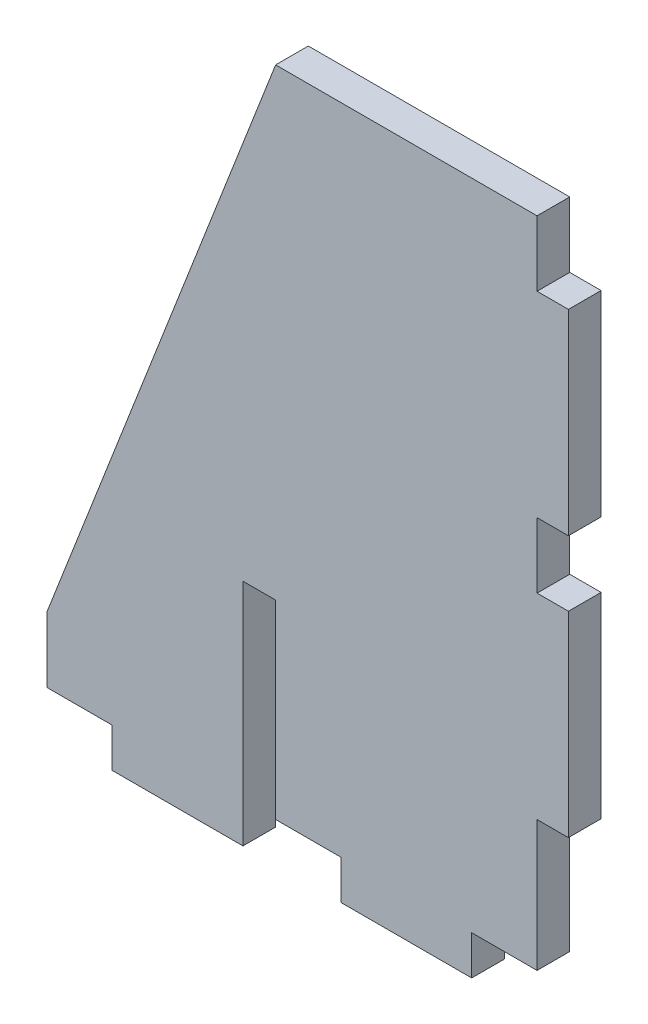
ISO-10303-21;
HEADER;
FILE_DESCRIPTION(('STEP AP214'),'2;1');
FILE_NAME('part.step','',(''),(''),'','','');
FILE_SCHEMA(('AUTOMOTIVE_DESIGN { 1 0 10303 214 1 1 1 1 }'));
ENDSEC;
DATA;
#1=APPLICATION_CONTEXT('core data for automotive mechanical design processes');
#2=APPLICATION_PROTOCOL_DEFINITION('international standard','automotive_design',2000,#1);
#3=PRODUCT_CONTEXT('',#1,'mechanical');
#4=PRODUCT('Part','Part','',(#3));
#5=PRODUCT_RELATED_PRODUCT_CATEGORY('part','',(#4));
#6=PRODUCT_DEFINITION_FORMATION('','',#4);
#7=PRODUCT_DEFINITION_CONTEXT('part definition',#1,'design');
#8=PRODUCT_DEFINITION('design','',#6,#7);
#9=PRODUCT_DEFINITION_SHAPE('','',#8);
#10=(LENGTH_UNIT() NAMED_UNIT(*) SI_UNIT(.MILLI.,.METRE.));
#11=(NAMED_UNIT(*) PLANE_ANGLE_UNIT() SI_UNIT($,.RADIAN.));
#12=(NAMED_UNIT(*) SI_UNIT($,.STERADIAN.) SOLID_ANGLE_UNIT());
#13=UNCERTAINTY_MEASURE_WITH_UNIT(LENGTH_MEASURE(1.E-05),#10,'distance_accuracy_value','');
#14=(GEOMETRIC_REPRESENTATION_CONTEXT(3) GLOBAL_UNCERTAINTY_ASSIGNED_CONTEXT((#13)) GLOBAL_UNIT_ASSIGNED_CONTEXT((#10,
#11,#12)) REPRESENTATION_CONTEXT('',''));
#15=CARTESIAN_POINT('',(0.,0.,0.));
#16=DIRECTION('',(0.,0.,1.));
#17=DIRECTION('',(1.,0.,0.));
#18=AXIS2_PLACEMENT_3D('',#15,#16,#17);
#19=CARTESIAN_POINT('',(-19.05,0.,3.175));
#20=DIRECTION('',(0.,-1.,0.));
#21=DIRECTION('',(1.,0.,0.));
#22=AXIS2_PLACEMENT_3D('',#19,#20,#21);
#23=PLANE('',#22);
#24=DIRECTION('',(-1.,0.,0.));
#25=VECTOR('',#24,1.);
#26=CARTESIAN_POINT('',(-19.05,0.,0.));
#27=LINE('',#26,#25);
#28=CARTESIAN_POINT('',(-19.05,0.,0.));
#29=VERTEX_POINT('',#28);
#30=CARTESIAN_POINT('',(-25.4,0.,0.));
#31=VERTEX_POINT('',#30);
#32=EDGE_CURVE('E234',#29,#31,#27,.T.);
#33=ORIENTED_EDGE('',*,*,#32,.F.);
#34=DIRECTION('',(0.,0.,-1.));
#35=VECTOR('',#34,1.);
#36=CARTESIAN_POINT('',(-19.05,0.,3.175));
#37=LINE('',#36,#35);
#38=CARTESIAN_POINT('',(-19.05,0.,3.175));
#39=VERTEX_POINT('',#38);
#40=EDGE_CURVE('E11',#39,#29,#37,.T.);
#41=ORIENTED_EDGE('',*,*,#40,.F.);
#42=DIRECTION('',(-1.,0.,0.));
#43=VECTOR('',#42,1.);
#44=CARTESIAN_POINT('',(-19.05,0.,3.175));
#45=LINE('',#44,#43);
#46=CARTESIAN_POINT('',(-25.4,0.,3.175));
#47=VERTEX_POINT('',#46);
#48=EDGE_CURVE('E319',#39,#47,#45,.T.);
#49=ORIENTED_EDGE('',*,*,#48,.T.);
#50=DIRECTION('',(0.,0.,-1.));
#51=VECTOR('',#50,1.);
#52=CARTESIAN_POINT('',(-25.4,0.,3.175));
#53=LINE('',#52,#51);
#54=EDGE_CURVE('E42',#47,#31,#53,.T.);
#55=ORIENTED_EDGE('',*,*,#54,.T.);
#56=EDGE_LOOP('',(#33,#41,#49,#55));
#57=FACE_BOUND('',#56,.T.);
#58=ADVANCED_FACE('F39',(#57),#23,.T.);
#59=CARTESIAN_POINT('',(-19.05,0.,3.175));
#60=DIRECTION('',(1.,0.,0.));
#61=DIRECTION('',(0.,0.,-1.));
#62=AXIS2_PLACEMENT_3D('',#59,#60,#61);
#63=PLANE('',#62);
#64=DIRECTION('',(0.,-1.,0.));
#65=VECTOR('',#64,1.);
#66=CARTESIAN_POINT('',(-19.05,0.,0.));
#67=LINE('',#66,#65);
#68=CARTESIAN_POINT('',(-19.05,-3.81,0.));
#69=VERTEX_POINT('',#68);
#70=EDGE_CURVE('E130',#29,#69,#67,.T.);
#71=ORIENTED_EDGE('',*,*,#70,.T.);
#72=DIRECTION('',(0.,0.,-1.));
#73=VECTOR('',#72,1.);
#74=CARTESIAN_POINT('',(-19.05,-3.81,3.175));
#75=LINE('',#74,#73);
#76=CARTESIAN_POINT('',(-19.05,-3.81,3.175));
#77=VERTEX_POINT('',#76);
#78=EDGE_CURVE('E49',#77,#69,#75,.T.);
#79=ORIENTED_EDGE('',*,*,#78,.F.);
#80=DIRECTION('',(0.,-1.,0.));
#81=VECTOR('',#80,1.);
#82=CARTESIAN_POINT('',(-19.05,0.,3.175));
#83=LINE('',#82,#81);
#84=EDGE_CURVE('E207',#39,#77,#83,.T.);
#85=ORIENTED_EDGE('',*,*,#84,.F.);
#86=ORIENTED_EDGE('',*,*,#40,.T.);
#87=EDGE_LOOP('',(#71,#79,#85,#86));
#88=FACE_BOUND('',#87,.T.);
#89=ADVANCED_FACE('F533',(#88),#63,.F.);
#90=CARTESIAN_POINT('',(-19.05,-3.81,3.175));
#91=DIRECTION('',(0.,1.,0.));
#92=DIRECTION('',(-1.,0.,0.));
#93=AXIS2_PLACEMENT_3D('',#90,#91,#92);
#94=PLANE('',#93);
#95=DIRECTION('',(1.,0.,0.));
#96=VECTOR('',#95,1.);
#97=CARTESIAN_POINT('',(-19.05,-3.81,0.));
#98=LINE('',#97,#96);
#99=CARTESIAN_POINT('',(-6.35,-3.81,0.));
#100=VERTEX_POINT('',#99);
#101=EDGE_CURVE('E215',#69,#100,#98,.T.);
#102=ORIENTED_EDGE('',*,*,#101,.T.);
#103=DIRECTION('',(0.,0.,-1.));
#104=VECTOR('',#103,1.);
#105=CARTESIAN_POINT('',(-6.35,-3.81,3.175));
#106=LINE('',#105,#104);
#107=CARTESIAN_POINT('',(-6.35,-3.81,3.175));
#108=VERTEX_POINT('',#107);
#109=EDGE_CURVE('E212',#108,#100,#106,.T.);
#110=ORIENTED_EDGE('',*,*,#109,.F.);
#111=DIRECTION('',(1.,0.,0.));
#112=VECTOR('',#111,1.);
#113=CARTESIAN_POINT('',(-19.05,-3.81,3.175));
#114=LINE('',#113,#112);
#115=EDGE_CURVE('E199',#77,#108,#114,.T.);
#116=ORIENTED_EDGE('',*,*,#115,.F.);
#117=ORIENTED_EDGE('',*,*,#78,.T.);
#118=EDGE_LOOP('',(#102,#110,#116,#117));
#119=FACE_BOUND('',#118,.T.);
#120=ADVANCED_FACE('F213',(#119),#94,.F.);
#121=CARTESIAN_POINT('',(-6.35,-3.81,3.175));
#122=DIRECTION('',(-1.,0.,0.));
#123=DIRECTION('',(0.,0.,1.));
#124=AXIS2_PLACEMENT_3D('',#121,#122,#123);
#125=PLANE('',#124);
#126=DIRECTION('',(0.,1.,0.));
#127=VECTOR('',#126,1.);
#128=CARTESIAN_POINT('',(-6.35,-3.81,0.));
#129=LINE('',#128,#127);
#130=CARTESIAN_POINT('',(-6.35,0.,0.));
#131=VERTEX_POINT('',#130);
#132=EDGE_CURVE('E313',#100,#131,#129,.T.);
#133=ORIENTED_EDGE('',*,*,#132,.T.);
#134=DIRECTION('',(0.,0.,-1.));
#135=VECTOR('',#134,1.);
#136=CARTESIAN_POINT('',(-6.35,0.,3.175));
#137=LINE('',#136,#135);
#138=CARTESIAN_POINT('',(-6.35,0.,3.175));
#139=VERTEX_POINT('',#138);
#140=EDGE_CURVE('E220',#139,#131,#137,.T.);
#141=ORIENTED_EDGE('',*,*,#140,.F.);
#142=DIRECTION('',(0.,1.,0.));
#143=VECTOR('',#142,1.);
#144=CARTESIAN_POINT('',(-6.35,-3.81,3.175));
#145=LINE('',#144,#143);
#146=EDGE_CURVE('E205',#108,#139,#145,.T.);
#147=ORIENTED_EDGE('',*,*,#146,.F.);
#148=ORIENTED_EDGE('',*,*,#109,.T.);
#149=EDGE_LOOP('',(#133,#141,#147,#148));
#150=FACE_BOUND('',#149,.T.);
#151=ADVANCED_FACE('F222',(#150),#125,.F.);
#152=CARTESIAN_POINT('',(0.,0.,3.175));
#153=DIRECTION('',(0.,-1.,0.));
#154=DIRECTION('',(1.,0.,0.));
#155=AXIS2_PLACEMENT_3D('',#152,#153,#154);
#156=PLANE('',#155);
#157=DIRECTION('',(-1.,0.,0.));
#158=VECTOR('',#157,1.);
#159=CARTESIAN_POINT('',(0.,0.,0.));
#160=LINE('',#159,#158);
#161=CARTESIAN_POINT('',(0.,0.,0.));
#162=VERTEX_POINT('',#161);
#163=EDGE_CURVE('E309',#162,#131,#160,.T.);
#164=ORIENTED_EDGE('',*,*,#163,.F.);
#165=DIRECTION('',(0.,0.,-1.));
#166=VECTOR('',#165,1.);
#167=CARTESIAN_POINT('',(0.,0.,3.175));
#168=LINE('',#167,#166);
#169=CARTESIAN_POINT('',(0.,0.,3.175));
#170=VERTEX_POINT('',#169);
#171=EDGE_CURVE('E325',#170,#162,#168,.T.);
#172=ORIENTED_EDGE('',*,*,#171,.F.);
#173=DIRECTION('',(-1.,0.,0.));
#174=VECTOR('',#173,1.);
#175=CARTESIAN_POINT('',(0.,0.,3.175));
#176=LINE('',#175,#174);
#177=EDGE_CURVE('E225',#170,#139,#176,.T.);
#178=ORIENTED_EDGE('',*,*,#177,.T.);
#179=ORIENTED_EDGE('',*,*,#140,.T.);
#180=EDGE_LOOP('',(#164,#172,#178,#179));
#181=FACE_BOUND('',#180,.T.);
#182=ADVANCED_FACE('F387',(#181),#156,.T.);
#183=CARTESIAN_POINT('',(0.,0.,3.175));
#184=DIRECTION('',(-1.,0.,0.));
#185=DIRECTION('',(0.,-1.,0.));
#186=AXIS2_PLACEMENT_3D('',#183,#184,#185);
#187=PLANE('',#186);
#188=DIRECTION('',(0.,1.,0.));
#189=VECTOR('',#188,1.);
#190=CARTESIAN_POINT('',(0.,0.,0.));
#191=LINE('',#190,#189);
#192=CARTESIAN_POINT('',(0.,12.7,0.));
#193=VERTEX_POINT('',#192);
#194=EDGE_CURVE('E305',#162,#193,#191,.T.);
#195=ORIENTED_EDGE('',*,*,#194,.T.);
#196=DIRECTION('',(0.,0.,-1.));
#197=VECTOR('',#196,1.);
#198=CARTESIAN_POINT('',(0.,12.7,3.175));
#199=LINE('',#198,#197);
#200=CARTESIAN_POINT('',(0.,12.7,3.175));
#201=VERTEX_POINT('',#200);
#202=EDGE_CURVE('E328',#201,#193,#199,.T.);
#203=ORIENTED_EDGE('',*,*,#202,.F.);
#204=DIRECTION('',(0.,1.,0.));
#205=VECTOR('',#204,1.);
#206=CARTESIAN_POINT('',(0.,0.,3.175));
#207=LINE('',#206,#205);
#208=EDGE_CURVE('E228',#170,#201,#207,.T.);
#209=ORIENTED_EDGE('',*,*,#208,.F.);
#210=ORIENTED_EDGE('',*,*,#171,.T.);
#211=EDGE_LOOP('',(#195,#203,#209,#210));
#212=FACE_BOUND('',#211,.T.);
#213=ADVANCED_FACE('F397',(#212),#187,.F.);
#214=CARTESIAN_POINT('',(3.048,12.7,3.175));
#215=DIRECTION('',(0.,-1.,0.));
#216=DIRECTION('',(0.,0.,-1.));
#217=AXIS2_PLACEMENT_3D('',#214,#215,#216);
#218=PLANE('',#217);
#219=DIRECTION('',(-1.,0.,0.));
#220=VECTOR('',#219,1.);
#221=CARTESIAN_POINT('',(3.048,12.7,0.));
#222=LINE('',#221,#220);
#223=CARTESIAN_POINT('',(3.048,12.7,0.));
#224=VERTEX_POINT('',#223);
#225=EDGE_CURVE('E301',#224,#193,#222,.T.);
#226=ORIENTED_EDGE('',*,*,#225,.F.);
#227=DIRECTION('',(0.,0.,-1.));
#228=VECTOR('',#227,1.);
#229=CARTESIAN_POINT('',(3.048,12.7,3.175));
#230=LINE('',#229,#228);
#231=CARTESIAN_POINT('',(3.048,12.7,3.175));
#232=VERTEX_POINT('',#231);
#233=EDGE_CURVE('E331',#232,#224,#230,.T.);
#234=ORIENTED_EDGE('',*,*,#233,.F.);
#235=DIRECTION('',(-1.,0.,0.));
#236=VECTOR('',#235,1.);
#237=CARTESIAN_POINT('',(3.048,12.7,3.175));
#238=LINE('',#237,#236);
#239=EDGE_CURVE('E393',#232,#201,#238,.T.);
#240=ORIENTED_EDGE('',*,*,#239,.T.);
#241=ORIENTED_EDGE('',*,*,#202,.T.);
#242=EDGE_LOOP('',(#226,#234,#240,#241));
#243=FACE_BOUND('',#242,.T.);
#244=ADVANCED_FACE('F400',(#243),#218,.T.);
#245=CARTESIAN_POINT('',(3.048,31.75,3.175));
#246=DIRECTION('',(1.,0.,0.));
#247=DIRECTION('',(0.,1.,0.));
#248=AXIS2_PLACEMENT_3D('',#245,#246,#247);
#249=PLANE('',#248);
#250=DIRECTION('',(0.,-1.,0.));
#251=VECTOR('',#250,1.);
#252=CARTESIAN_POINT('',(3.048,31.75,0.));
#253=LINE('',#252,#251);
#254=CARTESIAN_POINT('',(3.048,31.75,0.));
#255=VERTEX_POINT('',#254);
#256=EDGE_CURVE('E297',#255,#224,#253,.T.);
#257=ORIENTED_EDGE('',*,*,#256,.F.);
#258=DIRECTION('',(0.,0.,-1.));
#259=VECTOR('',#258,1.);
#260=CARTESIAN_POINT('',(3.048,31.75,3.175));
#261=LINE('',#260,#259);
#262=CARTESIAN_POINT('',(3.048,31.75,3.175));
#263=VERTEX_POINT('',#262);
#264=EDGE_CURVE('E334',#263,#255,#261,.T.);
#265=ORIENTED_EDGE('',*,*,#264,.F.);
#266=DIRECTION('',(0.,-1.,0.));
#267=VECTOR('',#266,1.);
#268=CARTESIAN_POINT('',(3.048,31.75,3.175));
#269=LINE('',#268,#267);
#270=EDGE_CURVE('E402',#263,#232,#269,.T.);
#271=ORIENTED_EDGE('',*,*,#270,.T.);
#272=ORIENTED_EDGE('',*,*,#233,.T.);
#273=EDGE_LOOP('',(#257,#265,#271,#272));
#274=FACE_BOUND('',#273,.T.);
#275=ADVANCED_FACE('F523',(#274),#249,.T.);
#276=CARTESIAN_POINT('',(0.,31.75,3.175));
#277=DIRECTION('',(0.,1.,0.));
#278=DIRECTION('',(0.,0.,1.));
#279=AXIS2_PLACEMENT_3D('',#276,#277,#278);
#280=PLANE('',#279);
#281=DIRECTION('',(1.,0.,0.));
#282=VECTOR('',#281,1.);
#283=CARTESIAN_POINT('',(0.,31.75,0.));
#284=LINE('',#283,#282);
#285=CARTESIAN_POINT('',(0.,31.75,0.));
#286=VERTEX_POINT('',#285);
#287=EDGE_CURVE('E293',#286,#255,#284,.T.);
#288=ORIENTED_EDGE('',*,*,#287,.F.);
#289=DIRECTION('',(0.,0.,-1.));
#290=VECTOR('',#289,1.);
#291=CARTESIAN_POINT('',(0.,31.75,3.175));
#292=LINE('',#291,#290);
#293=CARTESIAN_POINT('',(0.,31.75,3.175));
#294=VERTEX_POINT('',#293);
#295=EDGE_CURVE('E337',#294,#286,#292,.T.);
#296=ORIENTED_EDGE('',*,*,#295,.F.);
#297=DIRECTION('',(1.,0.,0.));
#298=VECTOR('',#297,1.);
#299=CARTESIAN_POINT('',(0.,31.75,3.175));
#300=LINE('',#299,#298);
#301=EDGE_CURVE('E405',#294,#263,#300,.T.);
#302=ORIENTED_EDGE('',*,*,#301,.T.);
#303=ORIENTED_EDGE('',*,*,#264,.T.);
#304=EDGE_LOOP('',(#288,#296,#302,#303));
#305=FACE_BOUND('',#304,.T.);
#306=ADVANCED_FACE('F519',(#305),#280,.T.);
#307=CARTESIAN_POINT('',(0.,31.75,3.175));
#308=DIRECTION('',(-1.,0.,0.));
#309=DIRECTION('',(0.,0.,1.));
#310=AXIS2_PLACEMENT_3D('',#307,#308,#309);
#311=PLANE('',#310);
#312=DIRECTION('',(0.,1.,0.));
#313=VECTOR('',#312,1.);
#314=CARTESIAN_POINT('',(0.,31.75,0.));
#315=LINE('',#314,#313);
#316=CARTESIAN_POINT('',(0.,38.1,0.));
#317=VERTEX_POINT('',#316);
#318=EDGE_CURVE('E289',#286,#317,#315,.T.);
#319=ORIENTED_EDGE('',*,*,#318,.T.);
#320=DIRECTION('',(0.,0.,-1.));
#321=VECTOR('',#320,1.);
#322=CARTESIAN_POINT('',(0.,38.1,3.175));
#323=LINE('',#322,#321);
#324=CARTESIAN_POINT('',(0.,38.1,3.175));
#325=VERTEX_POINT('',#324);
#326=EDGE_CURVE('E340',#325,#317,#323,.T.);
#327=ORIENTED_EDGE('',*,*,#326,.F.);
#328=DIRECTION('',(0.,1.,0.));
#329=VECTOR('',#328,1.);
#330=CARTESIAN_POINT('',(0.,31.75,3.175));
#331=LINE('',#330,#329);
#332=EDGE_CURVE('E411',#294,#325,#331,.T.);
#333=ORIENTED_EDGE('',*,*,#332,.F.);
#334=ORIENTED_EDGE('',*,*,#295,.T.);
#335=EDGE_LOOP('',(#319,#327,#333,#334));
#336=FACE_BOUND('',#335,.T.);
#337=ADVANCED_FACE('F516',(#336),#311,.F.);
#338=CARTESIAN_POINT('',(3.048,38.1,3.175));
#339=DIRECTION('',(0.,-1.,0.));
#340=DIRECTION('',(0.,0.,-1.));
#341=AXIS2_PLACEMENT_3D('',#338,#339,#340);
#342=PLANE('',#341);
#343=DIRECTION('',(-1.,0.,0.));
#344=VECTOR('',#343,1.);
#345=CARTESIAN_POINT('',(3.048,38.1,0.));
#346=LINE('',#345,#344);
#347=CARTESIAN_POINT('',(3.048,38.1,0.));
#348=VERTEX_POINT('',#347);
#349=EDGE_CURVE('E285',#348,#317,#346,.T.);
#350=ORIENTED_EDGE('',*,*,#349,.F.);
#351=DIRECTION('',(0.,0.,-1.));
#352=VECTOR('',#351,1.);
#353=CARTESIAN_POINT('',(3.048,38.1,3.175));
#354=LINE('',#353,#352);
#355=CARTESIAN_POINT('',(3.048,38.1,3.175));
#356=VERTEX_POINT('',#355);
#357=EDGE_CURVE('E343',#356,#348,#354,.T.);
#358=ORIENTED_EDGE('',*,*,#357,.F.);
#359=DIRECTION('',(-1.,0.,0.));
#360=VECTOR('',#359,1.);
#361=CARTESIAN_POINT('',(3.048,38.1,3.175));
#362=LINE('',#361,#360);
#363=EDGE_CURVE('E414',#356,#325,#362,.T.);
#364=ORIENTED_EDGE('',*,*,#363,.T.);
#365=ORIENTED_EDGE('',*,*,#326,.T.);
#366=EDGE_LOOP('',(#350,#358,#364,#365));
#367=FACE_BOUND('',#366,.T.);
#368=ADVANCED_FACE('F512',(#367),#342,.T.);
#369=CARTESIAN_POINT('',(3.048,57.15,3.175));
#370=DIRECTION('',(1.,0.,0.));
#371=DIRECTION('',(0.,1.,0.));
#372=AXIS2_PLACEMENT_3D('',#369,#370,#371);
#373=PLANE('',#372);
#374=DIRECTION('',(0.,-1.,0.));
#375=VECTOR('',#374,1.);
#376=CARTESIAN_POINT('',(3.048,57.15,0.));
#377=LINE('',#376,#375);
#378=CARTESIAN_POINT('',(3.048,57.15,0.));
#379=VERTEX_POINT('',#378);
#380=EDGE_CURVE('E281',#379,#348,#377,.T.);
#381=ORIENTED_EDGE('',*,*,#380,.F.);
#382=DIRECTION('',(0.,0.,-1.));
#383=VECTOR('',#382,1.);
#384=CARTESIAN_POINT('',(3.048,57.15,3.175));
#385=LINE('',#384,#383);
#386=CARTESIAN_POINT('',(3.048,57.15,3.175));
#387=VERTEX_POINT('',#386);
#388=EDGE_CURVE('E346',#387,#379,#385,.T.);
#389=ORIENTED_EDGE('',*,*,#388,.F.);
#390=DIRECTION('',(0.,-1.,0.));
#391=VECTOR('',#390,1.);
#392=CARTESIAN_POINT('',(3.048,57.15,3.175));
#393=LINE('',#392,#391);
#394=EDGE_CURVE('E418',#387,#356,#393,.T.);
#395=ORIENTED_EDGE('',*,*,#394,.T.);
#396=ORIENTED_EDGE('',*,*,#357,.T.);
#397=EDGE_LOOP('',(#381,#389,#395,#396));
#398=FACE_BOUND('',#397,.T.);
#399=ADVANCED_FACE('F508',(#398),#373,.T.);
#400=CARTESIAN_POINT('',(0.,57.15,3.175));
#401=DIRECTION('',(0.,1.,0.));
#402=DIRECTION('',(0.,0.,1.));
#403=AXIS2_PLACEMENT_3D('',#400,#401,#402);
#404=PLANE('',#403);
#405=DIRECTION('',(1.,0.,0.));
#406=VECTOR('',#405,1.);
#407=CARTESIAN_POINT('',(0.,57.15,0.));
#408=LINE('',#407,#406);
#409=CARTESIAN_POINT('',(0.,57.15,0.));
#410=VERTEX_POINT('',#409);
#411=EDGE_CURVE('E277',#410,#379,#408,.T.);
#412=ORIENTED_EDGE('',*,*,#411,.F.);
#413=DIRECTION('',(0.,0.,-1.));
#414=VECTOR('',#413,1.);
#415=CARTESIAN_POINT('',(0.,57.15,3.175));
#416=LINE('',#415,#414);
#417=CARTESIAN_POINT('',(0.,57.15,3.175));
#418=VERTEX_POINT('',#417);
#419=EDGE_CURVE('E349',#418,#410,#416,.T.);
#420=ORIENTED_EDGE('',*,*,#419,.F.);
#421=DIRECTION('',(1.,0.,0.));
#422=VECTOR('',#421,1.);
#423=CARTESIAN_POINT('',(0.,57.15,3.175));
#424=LINE('',#423,#422);
#425=EDGE_CURVE('E422',#418,#387,#424,.T.);
#426=ORIENTED_EDGE('',*,*,#425,.T.);
#427=ORIENTED_EDGE('',*,*,#388,.T.);
#428=EDGE_LOOP('',(#412,#420,#426,#427));
#429=FACE_BOUND('',#428,.T.);
#430=ADVANCED_FACE('F503',(#429),#404,.T.);
#431=CARTESIAN_POINT('',(0.,57.15,3.175));
#432=DIRECTION('',(-1.,0.,0.));
#433=DIRECTION('',(0.,0.,1.));
#434=AXIS2_PLACEMENT_3D('',#431,#432,#433);
#435=PLANE('',#434);
#436=DIRECTION('',(0.,1.,0.));
#437=VECTOR('',#436,1.);
#438=CARTESIAN_POINT('',(0.,57.15,0.));
#439=LINE('',#438,#437);
#440=CARTESIAN_POINT('',(0.,63.5,0.));
#441=VERTEX_POINT('',#440);
#442=EDGE_CURVE('E274',#410,#441,#439,.T.);
#443=ORIENTED_EDGE('',*,*,#442,.T.);
#444=DIRECTION('',(0.,0.,-1.));
#445=VECTOR('',#444,1.);
#446=CARTESIAN_POINT('',(0.,63.5,3.175));
#447=LINE('',#446,#445);
#448=CARTESIAN_POINT('',(0.,63.5,3.175));
#449=VERTEX_POINT('',#448);
#450=EDGE_CURVE('E352',#449,#441,#447,.T.);
#451=ORIENTED_EDGE('',*,*,#450,.F.);
#452=DIRECTION('',(0.,1.,0.));
#453=VECTOR('',#452,1.);
#454=CARTESIAN_POINT('',(0.,57.15,3.175));
#455=LINE('',#454,#453);
#456=EDGE_CURVE('E426',#418,#449,#455,.T.);
#457=ORIENTED_EDGE('',*,*,#456,.F.);
#458=ORIENTED_EDGE('',*,*,#419,.T.);
#459=EDGE_LOOP('',(#443,#451,#457,#458));
#460=FACE_BOUND('',#459,.T.);
#461=ADVANCED_FACE('F500',(#460),#435,.F.);
#462=CARTESIAN_POINT('',(0.,63.5,3.175));
#463=DIRECTION('',(0.,-1.,0.));
#464=DIRECTION('',(1.,0.,0.));
#465=AXIS2_PLACEMENT_3D('',#462,#463,#464);
#466=PLANE('',#465);
#467=DIRECTION('',(-1.,0.,0.));
#468=VECTOR('',#467,1.);
#469=CARTESIAN_POINT('',(0.,63.5,0.));
#470=LINE('',#469,#468);
#471=CARTESIAN_POINT('',(-25.4,63.5,0.));
#472=VERTEX_POINT('',#471);
#473=EDGE_CURVE('E270',#441,#472,#470,.T.);
#474=ORIENTED_EDGE('',*,*,#473,.T.);
#475=DIRECTION('',(0.,0.,-1.));
#476=VECTOR('',#475,1.);
#477=CARTESIAN_POINT('',(-25.4,63.5,3.175));
#478=LINE('',#477,#476);
#479=CARTESIAN_POINT('',(-25.4,63.5,3.175));
#480=VERTEX_POINT('',#479);
#481=EDGE_CURVE('E356',#480,#472,#478,.T.);
#482=ORIENTED_EDGE('',*,*,#481,.F.);
#483=DIRECTION('',(-1.,0.,0.));
#484=VECTOR('',#483,1.);
#485=CARTESIAN_POINT('',(0.,63.5,3.175));
#486=LINE('',#485,#484);
#487=EDGE_CURVE('E429',#449,#480,#486,.T.);
#488=ORIENTED_EDGE('',*,*,#487,.F.);
#489=ORIENTED_EDGE('',*,*,#450,.T.);
#490=EDGE_LOOP('',(#474,#482,#488,#489));
#491=FACE_BOUND('',#490,.T.);
#492=ADVANCED_FACE('F495',(#491),#466,.F.);
#493=CARTESIAN_POINT('',(-47.625,6.35000000000001,3.175));
#494=DIRECTION('',(-0.932004671541296,0.362446261154949,0.));
#495=DIRECTION('',(-0.362446261154949,-0.932004671541296,0.));
#496=AXIS2_PLACEMENT_3D('',#493,#494,#495);
#497=PLANE('',#496);
#498=DIRECTION('',(0.362446261154949,0.932004671541296,0.));
#499=VECTOR('',#498,1.);
#500=CARTESIAN_POINT('',(-47.625,6.35000000000001,0.));
#501=LINE('',#500,#499);
#502=CARTESIAN_POINT('',(-47.625,6.35000000000001,0.));
#503=VERTEX_POINT('',#502);
#504=EDGE_CURVE('E266',#503,#472,#501,.T.);
#505=ORIENTED_EDGE('',*,*,#504,.F.);
#506=DIRECTION('',(0.,0.,-1.));
#507=VECTOR('',#506,1.);
#508=CARTESIAN_POINT('',(-47.625,6.35000000000001,3.175));
#509=LINE('',#508,#507);
#510=CARTESIAN_POINT('',(-47.625,6.35000000000001,3.175));
#511=VERTEX_POINT('',#510);
#512=EDGE_CURVE('E359',#511,#503,#509,.T.);
#513=ORIENTED_EDGE('',*,*,#512,.F.);
#514=DIRECTION('',(0.362446261154949,0.932004671541296,0.));
#515=VECTOR('',#514,1.);
#516=CARTESIAN_POINT('',(-47.625,6.35000000000001,3.175));
#517=LINE('',#516,#515);
#518=EDGE_CURVE('E432',#511,#480,#517,.T.);
#519=ORIENTED_EDGE('',*,*,#518,.T.);
#520=ORIENTED_EDGE('',*,*,#481,.T.);
#521=EDGE_LOOP('',(#505,#513,#519,#520));
#522=FACE_BOUND('',#521,.T.);
#523=ADVANCED_FACE('F489',(#522),#497,.T.);
#524=CARTESIAN_POINT('',(-47.625,0.,3.175));
#525=DIRECTION('',(-1.,0.,0.));
#526=DIRECTION('',(0.,0.,1.));
#527=AXIS2_PLACEMENT_3D('',#524,#525,#526);
#528=PLANE('',#527);
#529=DIRECTION('',(0.,1.,0.));
#530=VECTOR('',#529,1.);
#531=CARTESIAN_POINT('',(-47.625,0.,0.));
#532=LINE('',#531,#530);
#533=CARTESIAN_POINT('',(-47.625,0.,0.));
#534=VERTEX_POINT('',#533);
#535=EDGE_CURVE('E262',#534,#503,#532,.T.);
#536=ORIENTED_EDGE('',*,*,#535,.F.);
#537=DIRECTION('',(0.,0.,-1.));
#538=VECTOR('',#537,1.);
#539=CARTESIAN_POINT('',(-47.625,0.,3.175));
#540=LINE('',#539,#538);
#541=CARTESIAN_POINT('',(-47.625,0.,3.175));
#542=VERTEX_POINT('',#541);
#543=EDGE_CURVE('E362',#542,#534,#540,.T.);
#544=ORIENTED_EDGE('',*,*,#543,.F.);
#545=DIRECTION('',(0.,1.,0.));
#546=VECTOR('',#545,1.);
#547=CARTESIAN_POINT('',(-47.625,0.,3.175));
#548=LINE('',#547,#546);
#549=EDGE_CURVE('E436',#542,#511,#548,.T.);
#550=ORIENTED_EDGE('',*,*,#549,.T.);
#551=ORIENTED_EDGE('',*,*,#512,.T.);
#552=EDGE_LOOP('',(#536,#544,#550,#551));
#553=FACE_BOUND('',#552,.T.);
#554=ADVANCED_FACE('F485',(#553),#528,.T.);
#555=CARTESIAN_POINT('',(-41.275,0.,3.175));
#556=DIRECTION('',(0.,-1.,0.));
#557=DIRECTION('',(1.,0.,0.));
#558=AXIS2_PLACEMENT_3D('',#555,#556,#557);
#559=PLANE('',#558);
#560=DIRECTION('',(-1.,0.,0.));
#561=VECTOR('',#560,1.);
#562=CARTESIAN_POINT('',(-41.275,0.,0.));
#563=LINE('',#562,#561);
#564=CARTESIAN_POINT('',(-41.275,0.,0.));
#565=VERTEX_POINT('',#564);
#566=EDGE_CURVE('E258',#565,#534,#563,.T.);
#567=ORIENTED_EDGE('',*,*,#566,.F.);
#568=DIRECTION('',(0.,0.,-1.));
#569=VECTOR('',#568,1.);
#570=CARTESIAN_POINT('',(-41.275,0.,3.175));
#571=LINE('',#570,#569);
#572=CARTESIAN_POINT('',(-41.275,0.,3.175));
#573=VERTEX_POINT('',#572);
#574=EDGE_CURVE('E365',#573,#565,#571,.T.);
#575=ORIENTED_EDGE('',*,*,#574,.F.);
#576=DIRECTION('',(-1.,0.,0.));
#577=VECTOR('',#576,1.);
#578=CARTESIAN_POINT('',(-41.275,0.,3.175));
#579=LINE('',#578,#577);
#580=EDGE_CURVE('E440',#573,#542,#579,.T.);
#581=ORIENTED_EDGE('',*,*,#580,.T.);
#582=ORIENTED_EDGE('',*,*,#543,.T.);
#583=EDGE_LOOP('',(#567,#575,#581,#582));
#584=FACE_BOUND('',#583,.T.);
#585=ADVANCED_FACE('F481',(#584),#559,.T.);
#586=CARTESIAN_POINT('',(-41.275,-3.80999999999999,3.175));
#587=DIRECTION('',(-1.,0.,0.));
#588=DIRECTION('',(0.,0.,1.));
#589=AXIS2_PLACEMENT_3D('',#586,#587,#588);
#590=PLANE('',#589);
#591=DIRECTION('',(0.,1.,0.));
#592=VECTOR('',#591,1.);
#593=CARTESIAN_POINT('',(-41.275,-3.80999999999999,0.));
#594=LINE('',#593,#592);
#595=CARTESIAN_POINT('',(-41.275,-3.80999999999999,0.));
#596=VERTEX_POINT('',#595);
#597=EDGE_CURVE('E254',#596,#565,#594,.T.);
#598=ORIENTED_EDGE('',*,*,#597,.F.);
#599=DIRECTION('',(0.,0.,-1.));
#600=VECTOR('',#599,1.);
#601=CARTESIAN_POINT('',(-41.275,-3.80999999999999,3.175));
#602=LINE('',#601,#600);
#603=CARTESIAN_POINT('',(-41.275,-3.80999999999999,3.175));
#604=VERTEX_POINT('',#603);
#605=EDGE_CURVE('E368',#604,#596,#602,.T.);
#606=ORIENTED_EDGE('',*,*,#605,.F.);
#607=DIRECTION('',(0.,1.,0.));
#608=VECTOR('',#607,1.);
#609=CARTESIAN_POINT('',(-41.275,-3.80999999999999,3.175));
#610=LINE('',#609,#608);
#611=EDGE_CURVE('E444',#604,#573,#610,.T.);
#612=ORIENTED_EDGE('',*,*,#611,.T.);
#613=ORIENTED_EDGE('',*,*,#574,.T.);
#614=EDGE_LOOP('',(#598,#606,#612,#613));
#615=FACE_BOUND('',#614,.T.);
#616=ADVANCED_FACE('F477',(#615),#590,.T.);
#617=CARTESIAN_POINT('',(-28.575,-3.81,3.175));
#618=DIRECTION('',(0.,-1.,0.));
#619=DIRECTION('',(1.,0.,0.));
#620=AXIS2_PLACEMENT_3D('',#617,#618,#619);
#621=PLANE('',#620);
#622=DIRECTION('',(-1.,0.,0.));
#623=VECTOR('',#622,1.);
#624=CARTESIAN_POINT('',(-28.575,-3.81,0.));
#625=LINE('',#624,#623);
#626=CARTESIAN_POINT('',(-28.575,-3.81,0.));
#627=VERTEX_POINT('',#626);
#628=EDGE_CURVE('E250',#627,#596,#625,.T.);
#629=ORIENTED_EDGE('',*,*,#628,.F.);
#630=DIRECTION('',(0.,0.,-1.));
#631=VECTOR('',#630,1.);
#632=CARTESIAN_POINT('',(-28.575,-3.81,3.175));
#633=LINE('',#632,#631);
#634=CARTESIAN_POINT('',(-28.575,-3.81,3.175));
#635=VERTEX_POINT('',#634);
#636=EDGE_CURVE('E371',#635,#627,#633,.T.);
#637=ORIENTED_EDGE('',*,*,#636,.F.);
#638=DIRECTION('',(-1.,0.,0.));
#639=VECTOR('',#638,1.);
#640=CARTESIAN_POINT('',(-28.575,-3.81,3.175));
#641=LINE('',#640,#639);
#642=EDGE_CURVE('E448',#635,#604,#641,.T.);
#643=ORIENTED_EDGE('',*,*,#642,.T.);
#644=ORIENTED_EDGE('',*,*,#605,.T.);
#645=EDGE_LOOP('',(#629,#637,#643,#644));
#646=FACE_BOUND('',#645,.T.);
#647=ADVANCED_FACE('F473',(#646),#621,.T.);
#648=CARTESIAN_POINT('',(-28.575,0.,3.175));
#649=DIRECTION('',(1.,0.,0.));
#650=DIRECTION('',(0.,0.,-1.));
#651=AXIS2_PLACEMENT_3D('',#648,#649,#650);
#652=PLANE('',#651);
#653=DIRECTION('',(0.,-1.,0.));
#654=VECTOR('',#653,1.);
#655=CARTESIAN_POINT('',(-28.575,0.,0.));
#656=LINE('',#655,#654);
#657=CARTESIAN_POINT('',(-28.575,18.4658,0.));
#658=VERTEX_POINT('',#657);
#659=EDGE_CURVE('E246',#658,#627,#656,.T.);
#660=ORIENTED_EDGE('',*,*,#659,.F.);
#661=DIRECTION('',(0.,0.,-1.));
#662=VECTOR('',#661,1.);
#663=CARTESIAN_POINT('',(-28.575,18.4658,3.175));
#664=LINE('',#663,#662);
#665=CARTESIAN_POINT('',(-28.575,18.4658,3.175));
#666=VERTEX_POINT('',#665);
#667=EDGE_CURVE('E374',#666,#658,#664,.T.);
#668=ORIENTED_EDGE('',*,*,#667,.F.);
#669=DIRECTION('',(0.,1.,0.));
#670=VECTOR('',#669,1.);
#671=CARTESIAN_POINT('',(-28.575,0.,3.175));
#672=LINE('',#671,#670);
#673=EDGE_CURVE('E452',#635,#666,#672,.T.);
#674=ORIENTED_EDGE('',*,*,#673,.F.);
#675=ORIENTED_EDGE('',*,*,#636,.T.);
#676=EDGE_LOOP('',(#660,#668,#674,#675));
#677=FACE_BOUND('',#676,.T.);
#678=ADVANCED_FACE('F470',(#677),#652,.T.);
#679=CARTESIAN_POINT('',(-25.4,18.4658,3.175));
#680=DIRECTION('',(0.,-1.,0.));
#681=DIRECTION('',(0.,0.,-1.));
#682=AXIS2_PLACEMENT_3D('',#679,#680,#681);
#683=PLANE('',#682);
#684=DIRECTION('',(-1.,0.,0.));
#685=VECTOR('',#684,1.);
#686=CARTESIAN_POINT('',(-25.4,18.4658,0.));
#687=LINE('',#686,#685);
#688=CARTESIAN_POINT('',(-25.4,18.4658,0.));
#689=VERTEX_POINT('',#688);
#690=EDGE_CURVE('E242',#689,#658,#687,.T.);
#691=ORIENTED_EDGE('',*,*,#690,.F.);
#692=DIRECTION('',(0.,0.,-1.));
#693=VECTOR('',#692,1.);
#694=CARTESIAN_POINT('',(-25.4,18.4658,3.175));
#695=LINE('',#694,#693);
#696=CARTESIAN_POINT('',(-25.4,18.4658,3.175));
#697=VERTEX_POINT('',#696);
#698=EDGE_CURVE('E377',#697,#689,#695,.T.);
#699=ORIENTED_EDGE('',*,*,#698,.F.);
#700=DIRECTION('',(-1.,0.,0.));
#701=VECTOR('',#700,1.);
#702=CARTESIAN_POINT('',(-25.4,18.4658,3.175));
#703=LINE('',#702,#701);
#704=EDGE_CURVE('E455',#697,#666,#703,.T.);
#705=ORIENTED_EDGE('',*,*,#704,.T.);
#706=ORIENTED_EDGE('',*,*,#667,.T.);
#707=EDGE_LOOP('',(#691,#699,#705,#706));
#708=FACE_BOUND('',#707,.T.);
#709=ADVANCED_FACE('F467',(#708),#683,.T.);
#710=CARTESIAN_POINT('',(-25.4,0.,3.175));
#711=DIRECTION('',(-1.,0.,0.));
#712=DIRECTION('',(0.,-1.,0.));
#713=AXIS2_PLACEMENT_3D('',#710,#711,#712);
#714=PLANE('',#713);
#715=DIRECTION('',(0.,1.,0.));
#716=VECTOR('',#715,1.);
#717=CARTESIAN_POINT('',(-25.4,0.,0.));
#718=LINE('',#717,#716);
#719=EDGE_CURVE('E238',#31,#689,#718,.T.);
#720=ORIENTED_EDGE('',*,*,#719,.F.);
#721=ORIENTED_EDGE('',*,*,#54,.F.);
#722=DIRECTION('',(0.,1.,0.));
#723=VECTOR('',#722,1.);
#724=CARTESIAN_POINT('',(-25.4,0.,3.175));
#725=LINE('',#724,#723);
#726=EDGE_CURVE('E459',#47,#697,#725,.T.);
#727=ORIENTED_EDGE('',*,*,#726,.T.);
#728=ORIENTED_EDGE('',*,*,#698,.T.);
#729=EDGE_LOOP('',(#720,#721,#727,#728));
#730=FACE_BOUND('',#729,.T.);
#731=ADVANCED_FACE('F381',(#730),#714,.T.);
#732=CARTESIAN_POINT('',(0.,0.,3.175));
#733=DIRECTION('',(0.,0.,-1.));
#734=DIRECTION('',(-1.,0.,0.));
#735=AXIS2_PLACEMENT_3D('',#732,#733,#734);
#736=PLANE('',#735);
#737=ORIENTED_EDGE('',*,*,#48,.F.);
#738=ORIENTED_EDGE('',*,*,#84,.T.);
#739=ORIENTED_EDGE('',*,*,#115,.T.);
#740=ORIENTED_EDGE('',*,*,#146,.T.);
#741=ORIENTED_EDGE('',*,*,#177,.F.);
#742=ORIENTED_EDGE('',*,*,#208,.T.);
#743=ORIENTED_EDGE('',*,*,#239,.F.);
#744=ORIENTED_EDGE('',*,*,#270,.F.);
#745=ORIENTED_EDGE('',*,*,#301,.F.);
#746=ORIENTED_EDGE('',*,*,#332,.T.);
#747=ORIENTED_EDGE('',*,*,#363,.F.);
#748=ORIENTED_EDGE('',*,*,#394,.F.);
#749=ORIENTED_EDGE('',*,*,#425,.F.);
#750=ORIENTED_EDGE('',*,*,#456,.T.);
#751=ORIENTED_EDGE('',*,*,#487,.T.);
#752=ORIENTED_EDGE('',*,*,#518,.F.);
#753=ORIENTED_EDGE('',*,*,#549,.F.);
#754=ORIENTED_EDGE('',*,*,#580,.F.);
#755=ORIENTED_EDGE('',*,*,#611,.F.);
#756=ORIENTED_EDGE('',*,*,#642,.F.);
#757=ORIENTED_EDGE('',*,*,#673,.T.);
#758=ORIENTED_EDGE('',*,*,#704,.F.);
#759=ORIENTED_EDGE('',*,*,#726,.F.);
#760=EDGE_LOOP('',(#737,#738,#739,#740,#741,#742,#743,#744,#745,#746,#747,#748,#749,#750,#751,
#752,#753,#754,#755,#756,#757,#758,#759));
#761=FACE_BOUND('',#760,.T.);
#762=ADVANCED_FACE('F202',(#761),#736,.F.);
#763=CARTESIAN_POINT('',(0.,0.,0.));
#764=DIRECTION('',(0.,0.,-1.));
#765=DIRECTION('',(-1.,0.,0.));
#766=AXIS2_PLACEMENT_3D('',#763,#764,#765);
#767=PLANE('',#766);
#768=ORIENTED_EDGE('',*,*,#32,.T.);
#769=ORIENTED_EDGE('',*,*,#719,.T.);
#770=ORIENTED_EDGE('',*,*,#690,.T.);
#771=ORIENTED_EDGE('',*,*,#659,.T.);
#772=ORIENTED_EDGE('',*,*,#628,.T.);
#773=ORIENTED_EDGE('',*,*,#597,.T.);
#774=ORIENTED_EDGE('',*,*,#566,.T.);
#775=ORIENTED_EDGE('',*,*,#535,.T.);
#776=ORIENTED_EDGE('',*,*,#504,.T.);
#777=ORIENTED_EDGE('',*,*,#473,.F.);
#778=ORIENTED_EDGE('',*,*,#442,.F.);
#779=ORIENTED_EDGE('',*,*,#411,.T.);
#780=ORIENTED_EDGE('',*,*,#380,.T.);
#781=ORIENTED_EDGE('',*,*,#349,.T.);
#782=ORIENTED_EDGE('',*,*,#318,.F.);
#783=ORIENTED_EDGE('',*,*,#287,.T.);
#784=ORIENTED_EDGE('',*,*,#256,.T.);
#785=ORIENTED_EDGE('',*,*,#225,.T.);
#786=ORIENTED_EDGE('',*,*,#194,.F.);
#787=ORIENTED_EDGE('',*,*,#163,.T.);
#788=ORIENTED_EDGE('',*,*,#132,.F.);
#789=ORIENTED_EDGE('',*,*,#101,.F.);
#790=ORIENTED_EDGE('',*,*,#70,.F.);
#791=EDGE_LOOP('',(#768,#769,#770,#771,#772,#773,#774,#775,#776,#777,#778,#779,#780,#781,#782,
#783,#784,#785,#786,#787,#788,#789,#790));
#792=FACE_BOUND('',#791,.T.);
#793=ADVANCED_FACE('F383',(#792),#767,.T.);
#794=CLOSED_SHELL('',(#58,#89,#120,#151,#182,#213,#244,#275,#306,#337,#368,#399,#430,#461,#492,
#523,#554,#585,#616,#647,#678,#709,#731,#762,#793));
#795=MANIFOLD_SOLID_BREP('B2',#794);
#796=ADVANCED_BREP_SHAPE_REPRESENTATION('',(#18,#795),#14);
#797=SHAPE_DEFINITION_REPRESENTATION(#9,#796);
ENDSEC;
END-ISO-10303-21;
